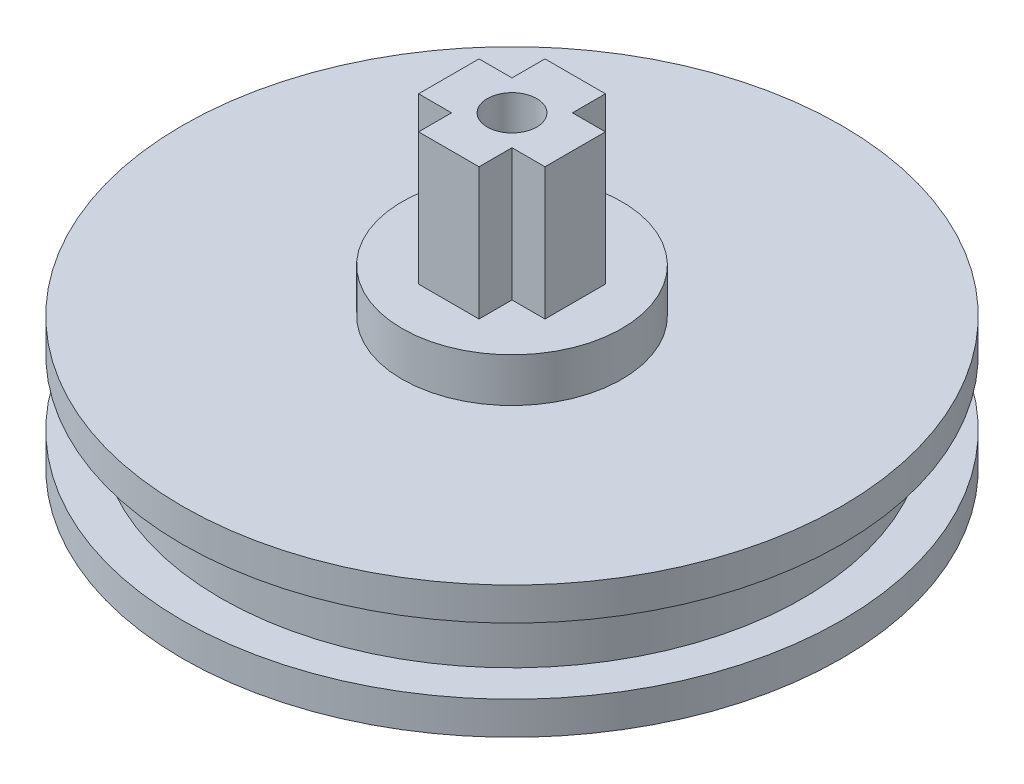
ISO-10303-21;
HEADER;
FILE_DESCRIPTION(('STEP AP214'),'2;1');
FILE_NAME('part.step','',(''),(''),'','','');
FILE_SCHEMA(('AUTOMOTIVE_DESIGN { 1 0 10303 214 1 1 1 1 }'));
ENDSEC;
DATA;
#1=APPLICATION_CONTEXT('core data for automotive mechanical design processes');
#2=APPLICATION_PROTOCOL_DEFINITION('international standard','automotive_design',2000,#1);
#3=PRODUCT_CONTEXT('',#1,'mechanical');
#4=PRODUCT('Part','Part','',(#3));
#5=PRODUCT_RELATED_PRODUCT_CATEGORY('part','',(#4));
#6=PRODUCT_DEFINITION_FORMATION('','',#4);
#7=PRODUCT_DEFINITION_CONTEXT('part definition',#1,'design');
#8=PRODUCT_DEFINITION('design','',#6,#7);
#9=PRODUCT_DEFINITION_SHAPE('','',#8);
#10=(LENGTH_UNIT() NAMED_UNIT(*) SI_UNIT(.MILLI.,.METRE.));
#11=(NAMED_UNIT(*) PLANE_ANGLE_UNIT() SI_UNIT($,.RADIAN.));
#12=(NAMED_UNIT(*) SI_UNIT($,.STERADIAN.) SOLID_ANGLE_UNIT());
#13=UNCERTAINTY_MEASURE_WITH_UNIT(LENGTH_MEASURE(1.E-05),#10,'distance_accuracy_value','');
#14=(GEOMETRIC_REPRESENTATION_CONTEXT(3) GLOBAL_UNCERTAINTY_ASSIGNED_CONTEXT((#13)) GLOBAL_UNIT_ASSIGNED_CONTEXT((#10,
#11,#12)) REPRESENTATION_CONTEXT('',''));
#15=CARTESIAN_POINT('',(0.,0.,0.));
#16=DIRECTION('',(0.,0.,1.));
#17=DIRECTION('',(1.,0.,0.));
#18=AXIS2_PLACEMENT_3D('',#15,#16,#17);
#19=CARTESIAN_POINT('',(0.,-18.,0.));
#20=DIRECTION('',(0.,1.,0.));
#21=DIRECTION('',(0.,0.,1.));
#22=AXIS2_PLACEMENT_3D('',#19,#20,#21);
#23=CYLINDRICAL_SURFACE('',#22,2.25);
#24=CARTESIAN_POINT('',(0.,28.,0.));
#25=DIRECTION('',(0.,1.,0.));
#26=DIRECTION('',(0.,0.,1.));
#27=AXIS2_PLACEMENT_3D('',#24,#25,#26);
#28=CIRCLE('',#27,2.25);
#29=CARTESIAN_POINT('',(0.,28.,2.25));
#30=VERTEX_POINT('',#29);
#31=EDGE_CURVE('E461',#30,#30,#28,.T.);
#32=ORIENTED_EDGE('',*,*,#31,.T.);
#33=EDGE_LOOP('',(#32));
#34=FACE_BOUND('',#33,.T.);
#35=CARTESIAN_POINT('',(0.,3.5,0.));
#36=DIRECTION('',(0.,-1.,0.));
#37=DIRECTION('',(0.,0.,-1.));
#38=AXIS2_PLACEMENT_3D('',#35,#36,#37);
#39=CIRCLE('',#38,2.25);
#40=CARTESIAN_POINT('',(0.,3.5,-2.25));
#41=VERTEX_POINT('',#40);
#42=EDGE_CURVE('E38',#41,#41,#39,.F.);
#43=ORIENTED_EDGE('',*,*,#42,.F.);
#44=EDGE_LOOP('',(#43));
#45=FACE_BOUND('',#44,.T.);
#46=ADVANCED_FACE('F34',(#34,#45),#23,.F.);
#47=CARTESIAN_POINT('',(0.,12.,0.));
#48=DIRECTION('',(0.,1.,0.));
#49=DIRECTION('',(0.,0.,1.));
#50=AXIS2_PLACEMENT_3D('',#47,#48,#49);
#51=PLANE('',#50);
#52=CARTESIAN_POINT('',(0.,12.,0.));
#53=DIRECTION('',(0.,1.,0.));
#54=DIRECTION('',(0.,0.,1.));
#55=AXIS2_PLACEMENT_3D('',#52,#53,#54);
#56=CIRCLE('',#55,10.);
#57=CARTESIAN_POINT('',(0.,12.,10.));
#58=VERTEX_POINT('',#57);
#59=EDGE_CURVE('E463',#58,#58,#56,.T.);
#60=ORIENTED_EDGE('',*,*,#59,.F.);
#61=EDGE_LOOP('',(#60));
#62=FACE_BOUND('',#61,.T.);
#63=CARTESIAN_POINT('',(0.,12.,0.));
#64=DIRECTION('',(0.,1.,0.));
#65=DIRECTION('',(0.,0.,1.));
#66=AXIS2_PLACEMENT_3D('',#63,#64,#65);
#67=CIRCLE('',#66,30.);
#68=CARTESIAN_POINT('',(0.,12.,30.));
#69=VERTEX_POINT('',#68);
#70=EDGE_CURVE('E175',#69,#69,#67,.T.);
#71=ORIENTED_EDGE('',*,*,#70,.T.);
#72=EDGE_LOOP('',(#71));
#73=FACE_BOUND('',#72,.T.);
#74=ADVANCED_FACE('F209',(#62,#73),#51,.T.);
#75=CARTESIAN_POINT('',(0.,3.,0.));
#76=DIRECTION('',(0.,-1.,0.));
#77=DIRECTION('',(0.,0.,-1.));
#78=AXIS2_PLACEMENT_3D('',#75,#76,#77);
#79=CYLINDRICAL_SURFACE('',#78,30.);
#80=CARTESIAN_POINT('',(0.,3.,0.));
#81=DIRECTION('',(0.,1.,0.));
#82=DIRECTION('',(0.,0.,1.));
#83=AXIS2_PLACEMENT_3D('',#80,#81,#82);
#84=CIRCLE('',#83,30.);
#85=CARTESIAN_POINT('',(0.,3.,30.));
#86=VERTEX_POINT('',#85);
#87=EDGE_CURVE('E186',#86,#86,#84,.T.);
#88=ORIENTED_EDGE('',*,*,#87,.F.);
#89=EDGE_LOOP('',(#88));
#90=FACE_BOUND('',#89,.T.);
#91=CARTESIAN_POINT('',(0.,0.,0.));
#92=DIRECTION('',(0.,1.,0.));
#93=DIRECTION('',(0.,0.,1.));
#94=AXIS2_PLACEMENT_3D('',#91,#92,#93);
#95=CIRCLE('',#94,30.);
#96=CARTESIAN_POINT('',(0.,0.,30.));
#97=VERTEX_POINT('',#96);
#98=EDGE_CURVE('E183',#97,#97,#95,.T.);
#99=ORIENTED_EDGE('',*,*,#98,.T.);
#100=EDGE_LOOP('',(#99));
#101=FACE_BOUND('',#100,.T.);
#102=ADVANCED_FACE('F36',(#90,#101),#79,.T.);
#103=CARTESIAN_POINT('',(0.,3.,0.));
#104=DIRECTION('',(0.,1.,0.));
#105=DIRECTION('',(0.,0.,1.));
#106=AXIS2_PLACEMENT_3D('',#103,#104,#105);
#107=PLANE('',#106);
#108=CARTESIAN_POINT('',(0.,3.,0.));
#109=DIRECTION('',(0.,1.,0.));
#110=DIRECTION('',(0.,0.,1.));
#111=AXIS2_PLACEMENT_3D('',#108,#109,#110);
#112=CIRCLE('',#111,26.5);
#113=CARTESIAN_POINT('',(0.,3.,26.5));
#114=VERTEX_POINT('',#113);
#115=EDGE_CURVE('E43',#114,#114,#112,.T.);
#116=ORIENTED_EDGE('',*,*,#115,.F.);
#117=EDGE_LOOP('',(#116));
#118=FACE_BOUND('',#117,.T.);
#119=ORIENTED_EDGE('',*,*,#87,.T.);
#120=EDGE_LOOP('',(#119));
#121=FACE_BOUND('',#120,.T.);
#122=ADVANCED_FACE('F196',(#118,#121),#107,.T.);
#123=CARTESIAN_POINT('',(0.,0.,0.));
#124=DIRECTION('',(0.,1.,0.));
#125=DIRECTION('',(0.,0.,1.));
#126=AXIS2_PLACEMENT_3D('',#123,#124,#125);
#127=PLANE('',#126);
#128=CARTESIAN_POINT('',(0.,0.,0.));
#129=DIRECTION('',(0.,-1.,0.));
#130=DIRECTION('',(0.,0.,-1.));
#131=AXIS2_PLACEMENT_3D('',#128,#129,#130);
#132=CIRCLE('',#131,6.5);
#133=CARTESIAN_POINT('',(0.,0.,-6.5));
#134=VERTEX_POINT('',#133);
#135=EDGE_CURVE('E457',#134,#134,#132,.T.);
#136=ORIENTED_EDGE('',*,*,#135,.F.);
#137=EDGE_LOOP('',(#136));
#138=FACE_BOUND('',#137,.T.);
#139=ORIENTED_EDGE('',*,*,#98,.F.);
#140=EDGE_LOOP('',(#139));
#141=FACE_BOUND('',#140,.T.);
#142=ADVANCED_FACE('F193',(#138,#141),#127,.F.);
#143=CARTESIAN_POINT('',(0.,9.,0.));
#144=DIRECTION('',(0.,-1.,0.));
#145=DIRECTION('',(0.,0.,-1.));
#146=AXIS2_PLACEMENT_3D('',#143,#144,#145);
#147=CYLINDRICAL_SURFACE('',#146,26.5);
#148=CARTESIAN_POINT('',(0.,9.,0.));
#149=DIRECTION('',(0.,1.,0.));
#150=DIRECTION('',(0.,0.,1.));
#151=AXIS2_PLACEMENT_3D('',#148,#149,#150);
#152=CIRCLE('',#151,26.5);
#153=CARTESIAN_POINT('',(0.,9.,26.5));
#154=VERTEX_POINT('',#153);
#155=EDGE_CURVE('E178',#154,#154,#152,.T.);
#156=ORIENTED_EDGE('',*,*,#155,.F.);
#157=EDGE_LOOP('',(#156));
#158=FACE_BOUND('',#157,.T.);
#159=ORIENTED_EDGE('',*,*,#115,.T.);
#160=EDGE_LOOP('',(#159));
#161=FACE_BOUND('',#160,.T.);
#162=ADVANCED_FACE('F195',(#158,#161),#147,.T.);
#163=CARTESIAN_POINT('',(0.,12.,0.));
#164=DIRECTION('',(0.,-1.,0.));
#165=DIRECTION('',(0.,0.,-1.));
#166=AXIS2_PLACEMENT_3D('',#163,#164,#165);
#167=CYLINDRICAL_SURFACE('',#166,30.);
#168=ORIENTED_EDGE('',*,*,#70,.F.);
#169=EDGE_LOOP('',(#168));
#170=FACE_BOUND('',#169,.T.);
#171=CARTESIAN_POINT('',(0.,9.,0.));
#172=DIRECTION('',(0.,1.,0.));
#173=DIRECTION('',(0.,0.,1.));
#174=AXIS2_PLACEMENT_3D('',#171,#172,#173);
#175=CIRCLE('',#174,30.);
#176=CARTESIAN_POINT('',(0.,9.,30.));
#177=VERTEX_POINT('',#176);
#178=EDGE_CURVE('E174',#177,#177,#175,.T.);
#179=ORIENTED_EDGE('',*,*,#178,.T.);
#180=EDGE_LOOP('',(#179));
#181=FACE_BOUND('',#180,.T.);
#182=ADVANCED_FACE('F202',(#170,#181),#167,.T.);
#183=CARTESIAN_POINT('',(0.,9.,0.));
#184=DIRECTION('',(0.,1.,0.));
#185=DIRECTION('',(0.,0.,1.));
#186=AXIS2_PLACEMENT_3D('',#183,#184,#185);
#187=PLANE('',#186);
#188=ORIENTED_EDGE('',*,*,#155,.T.);
#189=EDGE_LOOP('',(#188));
#190=FACE_BOUND('',#189,.T.);
#191=ORIENTED_EDGE('',*,*,#178,.F.);
#192=EDGE_LOOP('',(#191));
#193=FACE_BOUND('',#192,.T.);
#194=ADVANCED_FACE('F229',(#190,#193),#187,.F.);
#195=CARTESIAN_POINT('',(0.,16.,0.));
#196=DIRECTION('',(0.,-1.,0.));
#197=DIRECTION('',(0.,0.,-1.));
#198=AXIS2_PLACEMENT_3D('',#195,#196,#197);
#199=CYLINDRICAL_SURFACE('',#198,10.);
#200=CARTESIAN_POINT('',(0.,16.,0.));
#201=DIRECTION('',(0.,1.,0.));
#202=DIRECTION('',(0.,0.,1.));
#203=AXIS2_PLACEMENT_3D('',#200,#201,#202);
#204=CIRCLE('',#203,10.);
#205=CARTESIAN_POINT('',(0.,16.,10.));
#206=VERTEX_POINT('',#205);
#207=EDGE_CURVE('E138',#206,#206,#204,.T.);
#208=ORIENTED_EDGE('',*,*,#207,.F.);
#209=EDGE_LOOP('',(#208));
#210=FACE_BOUND('',#209,.T.);
#211=ORIENTED_EDGE('',*,*,#59,.T.);
#212=EDGE_LOOP('',(#211));
#213=FACE_BOUND('',#212,.T.);
#214=ADVANCED_FACE('F226',(#210,#213),#199,.T.);
#215=CARTESIAN_POINT('',(0.,16.,0.));
#216=DIRECTION('',(0.,1.,0.));
#217=DIRECTION('',(0.,0.,1.));
#218=AXIS2_PLACEMENT_3D('',#215,#216,#217);
#219=PLANE('',#218);
#220=DIRECTION('',(-1.,0.,0.));
#221=VECTOR('',#220,1.);
#222=CARTESIAN_POINT('',(0.,16.,-2.75));
#223=LINE('',#222,#221);
#224=CARTESIAN_POINT('',(-2.75,16.,-2.75));
#225=VERTEX_POINT('',#224);
#226=CARTESIAN_POINT('',(-5.75,16.,-2.75));
#227=VERTEX_POINT('',#226);
#228=EDGE_CURVE('E485',#225,#227,#223,.T.);
#229=ORIENTED_EDGE('',*,*,#228,.F.);
#230=DIRECTION('',(0.,0.,-1.));
#231=VECTOR('',#230,1.);
#232=CARTESIAN_POINT('',(-2.75,16.,0.));
#233=LINE('',#232,#231);
#234=CARTESIAN_POINT('',(-2.75,16.,-5.75));
#235=VERTEX_POINT('',#234);
#236=EDGE_CURVE('E50',#225,#235,#233,.T.);
#237=ORIENTED_EDGE('',*,*,#236,.T.);
#238=DIRECTION('',(-1.,0.,0.));
#239=VECTOR('',#238,1.);
#240=CARTESIAN_POINT('',(0.,16.,-5.75));
#241=LINE('',#240,#239);
#242=CARTESIAN_POINT('',(2.75,16.,-5.75));
#243=VERTEX_POINT('',#242);
#244=EDGE_CURVE('E11',#243,#235,#241,.T.);
#245=ORIENTED_EDGE('',*,*,#244,.F.);
#246=DIRECTION('',(0.,0.,-1.));
#247=VECTOR('',#246,1.);
#248=CARTESIAN_POINT('',(2.75,16.,0.));
#249=LINE('',#248,#247);
#250=CARTESIAN_POINT('',(2.75,16.,-2.75));
#251=VERTEX_POINT('',#250);
#252=EDGE_CURVE('E124',#251,#243,#249,.T.);
#253=ORIENTED_EDGE('',*,*,#252,.F.);
#254=DIRECTION('',(-1.,0.,0.));
#255=VECTOR('',#254,1.);
#256=CARTESIAN_POINT('',(0.,16.,-2.75));
#257=LINE('',#256,#255);
#258=CARTESIAN_POINT('',(5.75,16.,-2.75));
#259=VERTEX_POINT('',#258);
#260=EDGE_CURVE('E137',#259,#251,#257,.T.);
#261=ORIENTED_EDGE('',*,*,#260,.F.);
#262=DIRECTION('',(0.,0.,-1.));
#263=VECTOR('',#262,1.);
#264=CARTESIAN_POINT('',(5.75,16.,0.));
#265=LINE('',#264,#263);
#266=CARTESIAN_POINT('',(5.75,16.,2.75));
#267=VERTEX_POINT('',#266);
#268=EDGE_CURVE('E469',#267,#259,#265,.T.);
#269=ORIENTED_EDGE('',*,*,#268,.F.);
#270=DIRECTION('',(-1.,0.,0.));
#271=VECTOR('',#270,1.);
#272=CARTESIAN_POINT('',(0.,16.,2.75));
#273=LINE('',#272,#271);
#274=CARTESIAN_POINT('',(2.75,16.,2.75));
#275=VERTEX_POINT('',#274);
#276=EDGE_CURVE('E472',#267,#275,#273,.T.);
#277=ORIENTED_EDGE('',*,*,#276,.T.);
#278=DIRECTION('',(0.,0.,-1.));
#279=VECTOR('',#278,1.);
#280=CARTESIAN_POINT('',(2.75,16.,0.));
#281=LINE('',#280,#279);
#282=CARTESIAN_POINT('',(2.75,16.,5.75));
#283=VERTEX_POINT('',#282);
#284=EDGE_CURVE('E474',#283,#275,#281,.T.);
#285=ORIENTED_EDGE('',*,*,#284,.F.);
#286=DIRECTION('',(-1.,0.,0.));
#287=VECTOR('',#286,1.);
#288=CARTESIAN_POINT('',(0.,16.,5.75));
#289=LINE('',#288,#287);
#290=CARTESIAN_POINT('',(-2.75,16.,5.75));
#291=VERTEX_POINT('',#290);
#292=EDGE_CURVE('E477',#283,#291,#289,.T.);
#293=ORIENTED_EDGE('',*,*,#292,.T.);
#294=DIRECTION('',(0.,0.,-1.));
#295=VECTOR('',#294,1.);
#296=CARTESIAN_POINT('',(-2.75,16.,0.));
#297=LINE('',#296,#295);
#298=CARTESIAN_POINT('',(-2.75,16.,2.75));
#299=VERTEX_POINT('',#298);
#300=EDGE_CURVE('E479',#291,#299,#297,.T.);
#301=ORIENTED_EDGE('',*,*,#300,.T.);
#302=DIRECTION('',(-1.,0.,0.));
#303=VECTOR('',#302,1.);
#304=CARTESIAN_POINT('',(0.,16.,2.75));
#305=LINE('',#304,#303);
#306=CARTESIAN_POINT('',(-5.75,16.,2.75));
#307=VERTEX_POINT('',#306);
#308=EDGE_CURVE('E481',#299,#307,#305,.T.);
#309=ORIENTED_EDGE('',*,*,#308,.T.);
#310=DIRECTION('',(0.,0.,-1.));
#311=VECTOR('',#310,1.);
#312=CARTESIAN_POINT('',(-5.75,16.,0.));
#313=LINE('',#312,#311);
#314=EDGE_CURVE('E483',#307,#227,#313,.T.);
#315=ORIENTED_EDGE('',*,*,#314,.T.);
#316=EDGE_LOOP('',(#229,#237,#245,#253,#261,#269,#277,#285,#293,#301,#309,#315));
#317=FACE_BOUND('',#316,.T.);
#318=ORIENTED_EDGE('',*,*,#207,.T.);
#319=EDGE_LOOP('',(#318));
#320=FACE_BOUND('',#319,.T.);
#321=ADVANCED_FACE('F122',(#317,#320),#219,.T.);
#322=CARTESIAN_POINT('',(0.,28.,0.));
#323=DIRECTION('',(0.,1.,0.));
#324=DIRECTION('',(0.,0.,1.));
#325=AXIS2_PLACEMENT_3D('',#322,#323,#324);
#326=PLANE('',#325);
#327=ORIENTED_EDGE('',*,*,#31,.F.);
#328=EDGE_LOOP('',(#327));
#329=FACE_BOUND('',#328,.T.);
#330=DIRECTION('',(0.,0.,-1.));
#331=VECTOR('',#330,1.);
#332=CARTESIAN_POINT('',(-2.75,28.,0.));
#333=LINE('',#332,#331);
#334=CARTESIAN_POINT('',(-2.75,28.,-2.75));
#335=VERTEX_POINT('',#334);
#336=CARTESIAN_POINT('',(-2.75,28.,-5.75));
#337=VERTEX_POINT('',#336);
#338=EDGE_CURVE('E489',#335,#337,#333,.T.);
#339=ORIENTED_EDGE('',*,*,#338,.F.);
#340=DIRECTION('',(-1.,0.,0.));
#341=VECTOR('',#340,1.);
#342=CARTESIAN_POINT('',(0.,28.,-2.75));
#343=LINE('',#342,#341);
#344=CARTESIAN_POINT('',(-5.75,28.,-2.75));
#345=VERTEX_POINT('',#344);
#346=EDGE_CURVE('E492',#335,#345,#343,.T.);
#347=ORIENTED_EDGE('',*,*,#346,.T.);
#348=DIRECTION('',(0.,0.,-1.));
#349=VECTOR('',#348,1.);
#350=CARTESIAN_POINT('',(-5.75,28.,0.));
#351=LINE('',#350,#349);
#352=CARTESIAN_POINT('',(-5.75,28.,2.75));
#353=VERTEX_POINT('',#352);
#354=EDGE_CURVE('E494',#353,#345,#351,.T.);
#355=ORIENTED_EDGE('',*,*,#354,.F.);
#356=DIRECTION('',(-1.,0.,0.));
#357=VECTOR('',#356,1.);
#358=CARTESIAN_POINT('',(0.,28.,2.75));
#359=LINE('',#358,#357);
#360=CARTESIAN_POINT('',(-2.75,28.,2.75));
#361=VERTEX_POINT('',#360);
#362=EDGE_CURVE('E497',#361,#353,#359,.T.);
#363=ORIENTED_EDGE('',*,*,#362,.F.);
#364=DIRECTION('',(0.,0.,-1.));
#365=VECTOR('',#364,1.);
#366=CARTESIAN_POINT('',(-2.75,28.,0.));
#367=LINE('',#366,#365);
#368=CARTESIAN_POINT('',(-2.75,28.,5.75));
#369=VERTEX_POINT('',#368);
#370=EDGE_CURVE('E500',#369,#361,#367,.T.);
#371=ORIENTED_EDGE('',*,*,#370,.F.);
#372=DIRECTION('',(-1.,0.,0.));
#373=VECTOR('',#372,1.);
#374=CARTESIAN_POINT('',(0.,28.,5.75));
#375=LINE('',#374,#373);
#376=CARTESIAN_POINT('',(2.75,28.,5.75));
#377=VERTEX_POINT('',#376);
#378=EDGE_CURVE('E503',#377,#369,#375,.T.);
#379=ORIENTED_EDGE('',*,*,#378,.F.);
#380=DIRECTION('',(0.,0.,-1.));
#381=VECTOR('',#380,1.);
#382=CARTESIAN_POINT('',(2.75,28.,0.));
#383=LINE('',#382,#381);
#384=CARTESIAN_POINT('',(2.75,28.,2.75));
#385=VERTEX_POINT('',#384);
#386=EDGE_CURVE('E506',#377,#385,#383,.T.);
#387=ORIENTED_EDGE('',*,*,#386,.T.);
#388=DIRECTION('',(-1.,0.,0.));
#389=VECTOR('',#388,1.);
#390=CARTESIAN_POINT('',(0.,28.,2.75));
#391=LINE('',#390,#389);
#392=CARTESIAN_POINT('',(5.75,28.,2.75));
#393=VERTEX_POINT('',#392);
#394=EDGE_CURVE('E508',#393,#385,#391,.T.);
#395=ORIENTED_EDGE('',*,*,#394,.F.);
#396=DIRECTION('',(0.,0.,-1.));
#397=VECTOR('',#396,1.);
#398=CARTESIAN_POINT('',(5.75,28.,0.));
#399=LINE('',#398,#397);
#400=CARTESIAN_POINT('',(5.75,28.,-2.75));
#401=VERTEX_POINT('',#400);
#402=EDGE_CURVE('E511',#393,#401,#399,.T.);
#403=ORIENTED_EDGE('',*,*,#402,.T.);
#404=DIRECTION('',(-1.,0.,0.));
#405=VECTOR('',#404,1.);
#406=CARTESIAN_POINT('',(0.,28.,-2.75));
#407=LINE('',#406,#405);
#408=CARTESIAN_POINT('',(2.75,28.,-2.75));
#409=VERTEX_POINT('',#408);
#410=EDGE_CURVE('E513',#401,#409,#407,.T.);
#411=ORIENTED_EDGE('',*,*,#410,.T.);
#412=DIRECTION('',(0.,0.,-1.));
#413=VECTOR('',#412,1.);
#414=CARTESIAN_POINT('',(2.75,28.,0.));
#415=LINE('',#414,#413);
#416=CARTESIAN_POINT('',(2.75,28.,-5.75));
#417=VERTEX_POINT('',#416);
#418=EDGE_CURVE('E515',#409,#417,#415,.T.);
#419=ORIENTED_EDGE('',*,*,#418,.T.);
#420=DIRECTION('',(-1.,0.,0.));
#421=VECTOR('',#420,1.);
#422=CARTESIAN_POINT('',(0.,28.,-5.75));
#423=LINE('',#422,#421);
#424=EDGE_CURVE('E57',#417,#337,#423,.T.);
#425=ORIENTED_EDGE('',*,*,#424,.T.);
#426=EDGE_LOOP('',(#339,#347,#355,#363,#371,#379,#387,#395,#403,#411,#419,#425));
#427=FACE_BOUND('',#426,.T.);
#428=ADVANCED_FACE('F225',(#329,#427),#326,.T.);
#429=CARTESIAN_POINT('',(0.,28.,-5.75));
#430=DIRECTION('',(0.,0.,1.));
#431=DIRECTION('',(1.,0.,0.));
#432=AXIS2_PLACEMENT_3D('',#429,#430,#431);
#433=PLANE('',#432);
#434=DIRECTION('',(0.,-1.,0.));
#435=VECTOR('',#434,1.);
#436=CARTESIAN_POINT('',(2.75,28.,-5.75));
#437=LINE('',#436,#435);
#438=EDGE_CURVE('E134',#417,#243,#437,.T.);
#439=ORIENTED_EDGE('',*,*,#438,.T.);
#440=ORIENTED_EDGE('',*,*,#244,.T.);
#441=DIRECTION('',(0.,-1.,0.));
#442=VECTOR('',#441,1.);
#443=CARTESIAN_POINT('',(-2.75,28.,-5.75));
#444=LINE('',#443,#442);
#445=EDGE_CURVE('E141',#337,#235,#444,.T.);
#446=ORIENTED_EDGE('',*,*,#445,.F.);
#447=ORIENTED_EDGE('',*,*,#424,.F.);
#448=EDGE_LOOP('',(#439,#440,#446,#447));
#449=FACE_BOUND('',#448,.T.);
#450=ADVANCED_FACE('F140',(#449),#433,.F.);
#451=CARTESIAN_POINT('',(2.75,28.,0.));
#452=DIRECTION('',(-1.,0.,0.));
#453=DIRECTION('',(0.,0.,1.));
#454=AXIS2_PLACEMENT_3D('',#451,#452,#453);
#455=PLANE('',#454);
#456=DIRECTION('',(0.,-1.,0.));
#457=VECTOR('',#456,1.);
#458=CARTESIAN_POINT('',(2.75,28.,-2.75));
#459=LINE('',#458,#457);
#460=EDGE_CURVE('E136',#409,#251,#459,.T.);
#461=ORIENTED_EDGE('',*,*,#460,.T.);
#462=ORIENTED_EDGE('',*,*,#252,.T.);
#463=ORIENTED_EDGE('',*,*,#438,.F.);
#464=ORIENTED_EDGE('',*,*,#418,.F.);
#465=EDGE_LOOP('',(#461,#462,#463,#464));
#466=FACE_BOUND('',#465,.T.);
#467=ADVANCED_FACE('F132',(#466),#455,.F.);
#468=CARTESIAN_POINT('',(0.,28.,-2.75));
#469=DIRECTION('',(0.,0.,1.));
#470=DIRECTION('',(1.,0.,0.));
#471=AXIS2_PLACEMENT_3D('',#468,#469,#470);
#472=PLANE('',#471);
#473=DIRECTION('',(0.,-1.,0.));
#474=VECTOR('',#473,1.);
#475=CARTESIAN_POINT('',(5.75,28.,-2.75));
#476=LINE('',#475,#474);
#477=EDGE_CURVE('E143',#401,#259,#476,.T.);
#478=ORIENTED_EDGE('',*,*,#477,.T.);
#479=ORIENTED_EDGE('',*,*,#260,.T.);
#480=ORIENTED_EDGE('',*,*,#460,.F.);
#481=ORIENTED_EDGE('',*,*,#410,.F.);
#482=EDGE_LOOP('',(#478,#479,#480,#481));
#483=FACE_BOUND('',#482,.T.);
#484=ADVANCED_FACE('F238',(#483),#472,.F.);
#485=CARTESIAN_POINT('',(5.75,28.,0.));
#486=DIRECTION('',(-1.,0.,0.));
#487=DIRECTION('',(0.,0.,1.));
#488=AXIS2_PLACEMENT_3D('',#485,#486,#487);
#489=PLANE('',#488);
#490=DIRECTION('',(0.,-1.,0.));
#491=VECTOR('',#490,1.);
#492=CARTESIAN_POINT('',(5.75,28.,2.75));
#493=LINE('',#492,#491);
#494=EDGE_CURVE('E150',#393,#267,#493,.T.);
#495=ORIENTED_EDGE('',*,*,#494,.T.);
#496=ORIENTED_EDGE('',*,*,#268,.T.);
#497=ORIENTED_EDGE('',*,*,#477,.F.);
#498=ORIENTED_EDGE('',*,*,#402,.F.);
#499=EDGE_LOOP('',(#495,#496,#497,#498));
#500=FACE_BOUND('',#499,.T.);
#501=ADVANCED_FACE('F241',(#500),#489,.F.);
#502=CARTESIAN_POINT('',(0.,28.,2.75));
#503=DIRECTION('',(0.,0.,1.));
#504=DIRECTION('',(1.,0.,0.));
#505=AXIS2_PLACEMENT_3D('',#502,#503,#504);
#506=PLANE('',#505);
#507=ORIENTED_EDGE('',*,*,#276,.F.);
#508=ORIENTED_EDGE('',*,*,#494,.F.);
#509=ORIENTED_EDGE('',*,*,#394,.T.);
#510=DIRECTION('',(0.,-1.,0.));
#511=VECTOR('',#510,1.);
#512=CARTESIAN_POINT('',(2.75,28.,2.75));
#513=LINE('',#512,#511);
#514=EDGE_CURVE('E153',#385,#275,#513,.T.);
#515=ORIENTED_EDGE('',*,*,#514,.T.);
#516=EDGE_LOOP('',(#507,#508,#509,#515));
#517=FACE_BOUND('',#516,.T.);
#518=ADVANCED_FACE('F245',(#517),#506,.T.);
#519=CARTESIAN_POINT('',(2.75,28.,0.));
#520=DIRECTION('',(-1.,0.,0.));
#521=DIRECTION('',(0.,0.,1.));
#522=AXIS2_PLACEMENT_3D('',#519,#520,#521);
#523=PLANE('',#522);
#524=DIRECTION('',(0.,-1.,0.));
#525=VECTOR('',#524,1.);
#526=CARTESIAN_POINT('',(2.75,28.,5.75));
#527=LINE('',#526,#525);
#528=EDGE_CURVE('E156',#377,#283,#527,.T.);
#529=ORIENTED_EDGE('',*,*,#528,.T.);
#530=ORIENTED_EDGE('',*,*,#284,.T.);
#531=ORIENTED_EDGE('',*,*,#514,.F.);
#532=ORIENTED_EDGE('',*,*,#386,.F.);
#533=EDGE_LOOP('',(#529,#530,#531,#532));
#534=FACE_BOUND('',#533,.T.);
#535=ADVANCED_FACE('F249',(#534),#523,.F.);
#536=CARTESIAN_POINT('',(0.,28.,5.75));
#537=DIRECTION('',(0.,0.,1.));
#538=DIRECTION('',(1.,0.,0.));
#539=AXIS2_PLACEMENT_3D('',#536,#537,#538);
#540=PLANE('',#539);
#541=ORIENTED_EDGE('',*,*,#292,.F.);
#542=ORIENTED_EDGE('',*,*,#528,.F.);
#543=ORIENTED_EDGE('',*,*,#378,.T.);
#544=DIRECTION('',(0.,-1.,0.));
#545=VECTOR('',#544,1.);
#546=CARTESIAN_POINT('',(-2.75,28.,5.75));
#547=LINE('',#546,#545);
#548=EDGE_CURVE('E159',#369,#291,#547,.T.);
#549=ORIENTED_EDGE('',*,*,#548,.T.);
#550=EDGE_LOOP('',(#541,#542,#543,#549));
#551=FACE_BOUND('',#550,.T.);
#552=ADVANCED_FACE('F253',(#551),#540,.T.);
#553=CARTESIAN_POINT('',(-2.75,28.,0.));
#554=DIRECTION('',(-1.,0.,0.));
#555=DIRECTION('',(0.,0.,1.));
#556=AXIS2_PLACEMENT_3D('',#553,#554,#555);
#557=PLANE('',#556);
#558=ORIENTED_EDGE('',*,*,#300,.F.);
#559=ORIENTED_EDGE('',*,*,#548,.F.);
#560=ORIENTED_EDGE('',*,*,#370,.T.);
#561=DIRECTION('',(0.,-1.,0.));
#562=VECTOR('',#561,1.);
#563=CARTESIAN_POINT('',(-2.75,28.,2.75));
#564=LINE('',#563,#562);
#565=EDGE_CURVE('E162',#361,#299,#564,.T.);
#566=ORIENTED_EDGE('',*,*,#565,.T.);
#567=EDGE_LOOP('',(#558,#559,#560,#566));
#568=FACE_BOUND('',#567,.T.);
#569=ADVANCED_FACE('F257',(#568),#557,.T.);
#570=CARTESIAN_POINT('',(0.,28.,2.75));
#571=DIRECTION('',(0.,0.,1.));
#572=DIRECTION('',(1.,0.,0.));
#573=AXIS2_PLACEMENT_3D('',#570,#571,#572);
#574=PLANE('',#573);
#575=ORIENTED_EDGE('',*,*,#308,.F.);
#576=ORIENTED_EDGE('',*,*,#565,.F.);
#577=ORIENTED_EDGE('',*,*,#362,.T.);
#578=DIRECTION('',(0.,-1.,0.));
#579=VECTOR('',#578,1.);
#580=CARTESIAN_POINT('',(-5.75,28.,2.75));
#581=LINE('',#580,#579);
#582=EDGE_CURVE('E165',#353,#307,#581,.T.);
#583=ORIENTED_EDGE('',*,*,#582,.T.);
#584=EDGE_LOOP('',(#575,#576,#577,#583));
#585=FACE_BOUND('',#584,.T.);
#586=ADVANCED_FACE('F261',(#585),#574,.T.);
#587=CARTESIAN_POINT('',(-5.75,28.,0.));
#588=DIRECTION('',(-1.,0.,0.));
#589=DIRECTION('',(0.,0.,1.));
#590=AXIS2_PLACEMENT_3D('',#587,#588,#589);
#591=PLANE('',#590);
#592=ORIENTED_EDGE('',*,*,#314,.F.);
#593=ORIENTED_EDGE('',*,*,#582,.F.);
#594=ORIENTED_EDGE('',*,*,#354,.T.);
#595=DIRECTION('',(0.,-1.,0.));
#596=VECTOR('',#595,1.);
#597=CARTESIAN_POINT('',(-5.75,28.,-2.75));
#598=LINE('',#597,#596);
#599=EDGE_CURVE('E168',#345,#227,#598,.T.);
#600=ORIENTED_EDGE('',*,*,#599,.T.);
#601=EDGE_LOOP('',(#592,#593,#594,#600));
#602=FACE_BOUND('',#601,.T.);
#603=ADVANCED_FACE('F265',(#602),#591,.T.);
#604=CARTESIAN_POINT('',(0.,28.,-2.75));
#605=DIRECTION('',(0.,0.,1.));
#606=DIRECTION('',(1.,0.,0.));
#607=AXIS2_PLACEMENT_3D('',#604,#605,#606);
#608=PLANE('',#607);
#609=DIRECTION('',(0.,-1.,0.));
#610=VECTOR('',#609,1.);
#611=CARTESIAN_POINT('',(-2.75,28.,-2.75));
#612=LINE('',#611,#610);
#613=EDGE_CURVE('E171',#335,#225,#612,.T.);
#614=ORIENTED_EDGE('',*,*,#613,.T.);
#615=ORIENTED_EDGE('',*,*,#228,.T.);
#616=ORIENTED_EDGE('',*,*,#599,.F.);
#617=ORIENTED_EDGE('',*,*,#346,.F.);
#618=EDGE_LOOP('',(#614,#615,#616,#617));
#619=FACE_BOUND('',#618,.T.);
#620=ADVANCED_FACE('F269',(#619),#608,.F.);
#621=CARTESIAN_POINT('',(-2.75,28.,0.));
#622=DIRECTION('',(-1.,0.,0.));
#623=DIRECTION('',(0.,0.,1.));
#624=AXIS2_PLACEMENT_3D('',#621,#622,#623);
#625=PLANE('',#624);
#626=ORIENTED_EDGE('',*,*,#236,.F.);
#627=ORIENTED_EDGE('',*,*,#613,.F.);
#628=ORIENTED_EDGE('',*,*,#338,.T.);
#629=ORIENTED_EDGE('',*,*,#445,.T.);
#630=EDGE_LOOP('',(#626,#627,#628,#629));
#631=FACE_BOUND('',#630,.T.);
#632=ADVANCED_FACE('F273',(#631),#625,.T.);
#633=CARTESIAN_POINT('',(0.,3.5,0.));
#634=DIRECTION('',(0.,-1.,0.));
#635=DIRECTION('',(0.,0.,-1.));
#636=AXIS2_PLACEMENT_3D('',#633,#634,#635);
#637=PLANE('',#636);
#638=CARTESIAN_POINT('',(0.,3.5,0.));
#639=DIRECTION('',(0.,-1.,0.));
#640=DIRECTION('',(0.,0.,-1.));
#641=AXIS2_PLACEMENT_3D('',#638,#639,#640);
#642=CIRCLE('',#641,6.5);
#643=CARTESIAN_POINT('',(0.,3.5,-6.5));
#644=VERTEX_POINT('',#643);
#645=EDGE_CURVE('E455',#644,#644,#642,.T.);
#646=ORIENTED_EDGE('',*,*,#645,.T.);
#647=EDGE_LOOP('',(#646));
#648=FACE_BOUND('',#647,.T.);
#649=ORIENTED_EDGE('',*,*,#42,.T.);
#650=EDGE_LOOP('',(#649));
#651=FACE_BOUND('',#650,.T.);
#652=ADVANCED_FACE('F276',(#648,#651),#637,.T.);
#653=CARTESIAN_POINT('',(0.,3.5,0.));
#654=DIRECTION('',(0.,-1.,0.));
#655=DIRECTION('',(0.,0.,-1.));
#656=AXIS2_PLACEMENT_3D('',#653,#654,#655);
#657=CYLINDRICAL_SURFACE('',#656,6.5);
#658=ORIENTED_EDGE('',*,*,#645,.F.);
#659=EDGE_LOOP('',(#658));
#660=FACE_BOUND('',#659,.T.);
#661=ORIENTED_EDGE('',*,*,#135,.T.);
#662=EDGE_LOOP('',(#661));
#663=FACE_BOUND('',#662,.T.);
#664=ADVANCED_FACE('F221',(#660,#663),#657,.F.);
#665=CLOSED_SHELL('',(#46,#74,#102,#122,#142,#162,#182,#194,#214,#321,#428,#450,#467,#484,#501,
#518,#535,#552,#569,#586,#603,#620,#632,#652,#664));
#666=MANIFOLD_SOLID_BREP('B2',#665);
#667=ADVANCED_BREP_SHAPE_REPRESENTATION('',(#18,#666),#14);
#668=SHAPE_DEFINITION_REPRESENTATION(#9,#667);
ENDSEC;
END-ISO-10303-21;
